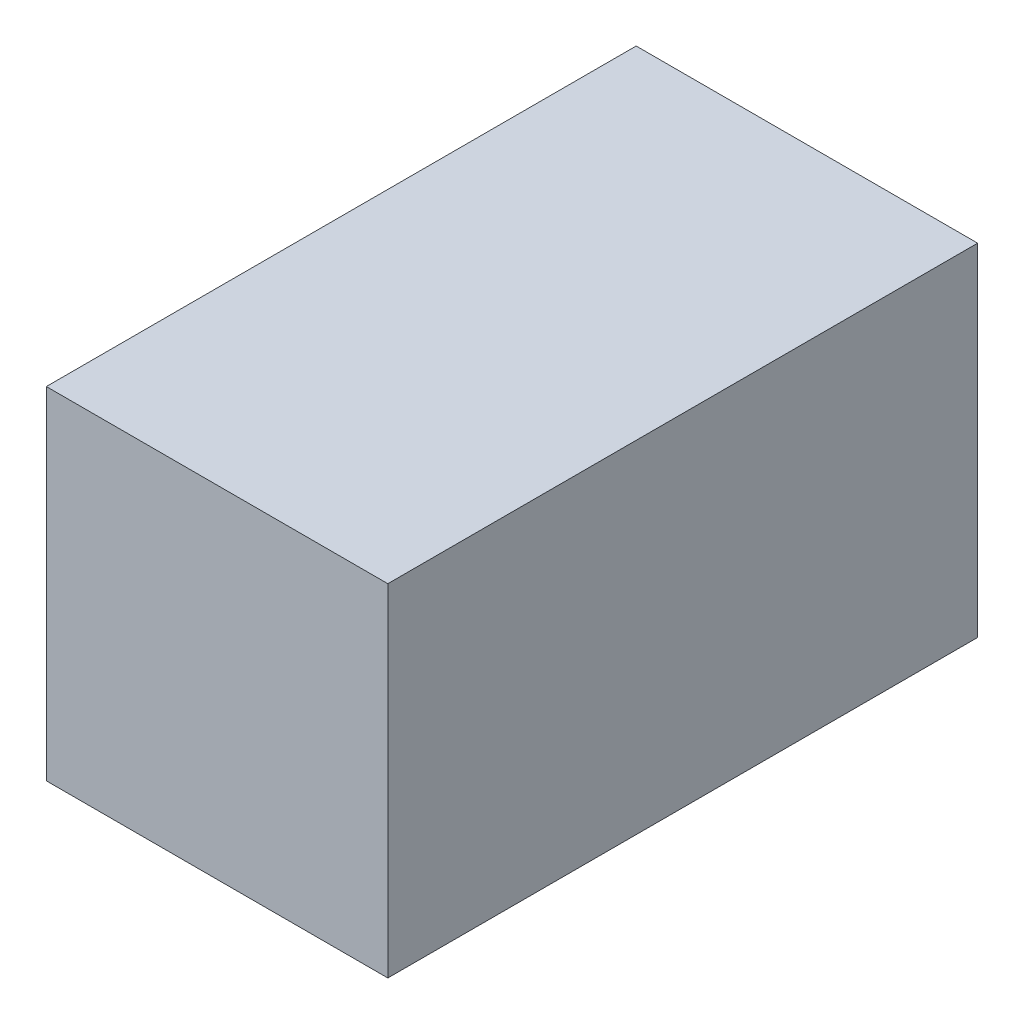
ISO-10303-21;
HEADER;
FILE_DESCRIPTION(('STEP AP214'),'2;1');
FILE_NAME('part.step','',(''),(''),'','','');
FILE_SCHEMA(('AUTOMOTIVE_DESIGN { 1 0 10303 214 1 1 1 1 }'));
ENDSEC;
DATA;
#1=APPLICATION_CONTEXT('core data for automotive mechanical design processes');
#2=APPLICATION_PROTOCOL_DEFINITION('international standard','automotive_design',2000,#1);
#3=PRODUCT_CONTEXT('',#1,'mechanical');
#4=PRODUCT('Part','Part','',(#3));
#5=PRODUCT_RELATED_PRODUCT_CATEGORY('part','',(#4));
#6=PRODUCT_DEFINITION_FORMATION('','',#4);
#7=PRODUCT_DEFINITION_CONTEXT('part definition',#1,'design');
#8=PRODUCT_DEFINITION('design','',#6,#7);
#9=PRODUCT_DEFINITION_SHAPE('','',#8);
#10=(LENGTH_UNIT() NAMED_UNIT(*) SI_UNIT(.MILLI.,.METRE.));
#11=(NAMED_UNIT(*) PLANE_ANGLE_UNIT() SI_UNIT($,.RADIAN.));
#12=(NAMED_UNIT(*) SI_UNIT($,.STERADIAN.) SOLID_ANGLE_UNIT());
#13=UNCERTAINTY_MEASURE_WITH_UNIT(LENGTH_MEASURE(1.E-05),#10,'distance_accuracy_value','');
#14=(GEOMETRIC_REPRESENTATION_CONTEXT(3) GLOBAL_UNCERTAINTY_ASSIGNED_CONTEXT((#13)) GLOBAL_UNIT_ASSIGNED_CONTEXT((#10,
#11,#12)) REPRESENTATION_CONTEXT('',''));
#15=CARTESIAN_POINT('',(0.,0.,0.));
#16=DIRECTION('',(0.,0.,1.));
#17=DIRECTION('',(1.,0.,0.));
#18=AXIS2_PLACEMENT_3D('',#15,#16,#17);
#19=CARTESIAN_POINT('',(-27.5,-27.5,95.));
#20=DIRECTION('',(-1.,0.,0.));
#21=DIRECTION('',(0.,0.,1.));
#22=AXIS2_PLACEMENT_3D('',#19,#20,#21);
#23=PLANE('',#22);
#24=DIRECTION('',(0.,1.,0.));
#25=VECTOR('',#24,1.);
#26=CARTESIAN_POINT('',(-27.5,-27.5,0.));
#27=LINE('',#26,#25);
#28=CARTESIAN_POINT('',(-27.5,-27.5,0.));
#29=VERTEX_POINT('',#28);
#30=CARTESIAN_POINT('',(-27.5,27.5,0.));
#31=VERTEX_POINT('',#30);
#32=EDGE_CURVE('E98',#29,#31,#27,.T.);
#33=ORIENTED_EDGE('',*,*,#32,.F.);
#34=DIRECTION('',(0.,0.,-1.));
#35=VECTOR('',#34,1.);
#36=CARTESIAN_POINT('',(-27.5,-27.5,95.));
#37=LINE('',#36,#35);
#38=CARTESIAN_POINT('',(-27.5,-27.5,95.));
#39=VERTEX_POINT('',#38);
#40=EDGE_CURVE('E11',#39,#29,#37,.T.);
#41=ORIENTED_EDGE('',*,*,#40,.F.);
#42=DIRECTION('',(0.,1.,0.));
#43=VECTOR('',#42,1.);
#44=CARTESIAN_POINT('',(-27.5,-27.5,95.));
#45=LINE('',#44,#43);
#46=CARTESIAN_POINT('',(-27.5,27.5,95.));
#47=VERTEX_POINT('',#46);
#48=EDGE_CURVE('E93',#39,#47,#45,.T.);
#49=ORIENTED_EDGE('',*,*,#48,.T.);
#50=DIRECTION('',(0.,0.,-1.));
#51=VECTOR('',#50,1.);
#52=CARTESIAN_POINT('',(-27.5,27.5,95.));
#53=LINE('',#52,#51);
#54=EDGE_CURVE('E36',#47,#31,#53,.T.);
#55=ORIENTED_EDGE('',*,*,#54,.T.);
#56=EDGE_LOOP('',(#33,#41,#49,#55));
#57=FACE_BOUND('',#56,.T.);
#58=ADVANCED_FACE('F33',(#57),#23,.T.);
#59=CARTESIAN_POINT('',(-27.5,-27.5,95.));
#60=DIRECTION('',(0.,1.,0.));
#61=DIRECTION('',(-1.,0.,0.));
#62=AXIS2_PLACEMENT_3D('',#59,#60,#61);
#63=PLANE('',#62);
#64=DIRECTION('',(1.,0.,0.));
#65=VECTOR('',#64,1.);
#66=CARTESIAN_POINT('',(-27.5,-27.5,0.));
#67=LINE('',#66,#65);
#68=CARTESIAN_POINT('',(27.5,-27.5,0.));
#69=VERTEX_POINT('',#68);
#70=EDGE_CURVE('E66',#29,#69,#67,.T.);
#71=ORIENTED_EDGE('',*,*,#70,.T.);
#72=DIRECTION('',(0.,0.,-1.));
#73=VECTOR('',#72,1.);
#74=CARTESIAN_POINT('',(27.5,-27.5,95.));
#75=LINE('',#74,#73);
#76=CARTESIAN_POINT('',(27.5,-27.5,95.));
#77=VERTEX_POINT('',#76);
#78=EDGE_CURVE('E42',#77,#69,#75,.T.);
#79=ORIENTED_EDGE('',*,*,#78,.F.);
#80=DIRECTION('',(1.,0.,0.));
#81=VECTOR('',#80,1.);
#82=CARTESIAN_POINT('',(-27.5,-27.5,95.));
#83=LINE('',#82,#81);
#84=EDGE_CURVE('E83',#39,#77,#83,.T.);
#85=ORIENTED_EDGE('',*,*,#84,.F.);
#86=ORIENTED_EDGE('',*,*,#40,.T.);
#87=EDGE_LOOP('',(#71,#79,#85,#86));
#88=FACE_BOUND('',#87,.T.);
#89=ADVANCED_FACE('F108',(#88),#63,.F.);
#90=CARTESIAN_POINT('',(27.5,-27.5,95.));
#91=DIRECTION('',(-1.,0.,0.));
#92=DIRECTION('',(0.,0.,1.));
#93=AXIS2_PLACEMENT_3D('',#90,#91,#92);
#94=PLANE('',#93);
#95=DIRECTION('',(0.,1.,0.));
#96=VECTOR('',#95,1.);
#97=CARTESIAN_POINT('',(27.5,-27.5,0.));
#98=LINE('',#97,#96);
#99=CARTESIAN_POINT('',(27.5,27.5,0.));
#100=VERTEX_POINT('',#99);
#101=EDGE_CURVE('E90',#69,#100,#98,.T.);
#102=ORIENTED_EDGE('',*,*,#101,.T.);
#103=DIRECTION('',(0.,0.,-1.));
#104=VECTOR('',#103,1.);
#105=CARTESIAN_POINT('',(27.5,27.5,95.));
#106=LINE('',#105,#104);
#107=CARTESIAN_POINT('',(27.5,27.5,95.));
#108=VERTEX_POINT('',#107);
#109=EDGE_CURVE('E87',#108,#100,#106,.T.);
#110=ORIENTED_EDGE('',*,*,#109,.F.);
#111=DIRECTION('',(0.,1.,0.));
#112=VECTOR('',#111,1.);
#113=CARTESIAN_POINT('',(27.5,-27.5,95.));
#114=LINE('',#113,#112);
#115=EDGE_CURVE('E78',#77,#108,#114,.T.);
#116=ORIENTED_EDGE('',*,*,#115,.F.);
#117=ORIENTED_EDGE('',*,*,#78,.T.);
#118=EDGE_LOOP('',(#102,#110,#116,#117));
#119=FACE_BOUND('',#118,.T.);
#120=ADVANCED_FACE('F88',(#119),#94,.F.);
#121=CARTESIAN_POINT('',(-27.5,27.5,95.));
#122=DIRECTION('',(0.,1.,0.));
#123=DIRECTION('',(0.,0.,1.));
#124=AXIS2_PLACEMENT_3D('',#121,#122,#123);
#125=PLANE('',#124);
#126=DIRECTION('',(1.,0.,0.));
#127=VECTOR('',#126,1.);
#128=CARTESIAN_POINT('',(-27.5,27.5,0.));
#129=LINE('',#128,#127);
#130=EDGE_CURVE('E101',#31,#100,#129,.T.);
#131=ORIENTED_EDGE('',*,*,#130,.F.);
#132=ORIENTED_EDGE('',*,*,#54,.F.);
#133=DIRECTION('',(1.,0.,0.));
#134=VECTOR('',#133,1.);
#135=CARTESIAN_POINT('',(-27.5,27.5,95.));
#136=LINE('',#135,#134);
#137=EDGE_CURVE('E82',#47,#108,#136,.T.);
#138=ORIENTED_EDGE('',*,*,#137,.T.);
#139=ORIENTED_EDGE('',*,*,#109,.T.);
#140=EDGE_LOOP('',(#131,#132,#138,#139));
#141=FACE_BOUND('',#140,.T.);
#142=ADVANCED_FACE('F92',(#141),#125,.T.);
#143=CARTESIAN_POINT('',(0.,0.,95.));
#144=DIRECTION('',(0.,0.,-1.));
#145=DIRECTION('',(-1.,0.,0.));
#146=AXIS2_PLACEMENT_3D('',#143,#144,#145);
#147=PLANE('',#146);
#148=ORIENTED_EDGE('',*,*,#48,.F.);
#149=ORIENTED_EDGE('',*,*,#84,.T.);
#150=ORIENTED_EDGE('',*,*,#115,.T.);
#151=ORIENTED_EDGE('',*,*,#137,.F.);
#152=EDGE_LOOP('',(#148,#149,#150,#151));
#153=FACE_BOUND('',#152,.T.);
#154=ADVANCED_FACE('F81',(#153),#147,.F.);
#155=CARTESIAN_POINT('',(0.,0.,0.));
#156=DIRECTION('',(0.,0.,-1.));
#157=DIRECTION('',(-1.,0.,0.));
#158=AXIS2_PLACEMENT_3D('',#155,#156,#157);
#159=PLANE('',#158);
#160=ORIENTED_EDGE('',*,*,#32,.T.);
#161=ORIENTED_EDGE('',*,*,#130,.T.);
#162=ORIENTED_EDGE('',*,*,#101,.F.);
#163=ORIENTED_EDGE('',*,*,#70,.F.);
#164=EDGE_LOOP('',(#160,#161,#162,#163));
#165=FACE_BOUND('',#164,.T.);
#166=ADVANCED_FACE('F106',(#165),#159,.T.);
#167=CLOSED_SHELL('',(#58,#89,#120,#142,#154,#166));
#168=MANIFOLD_SOLID_BREP('B2',#167);
#169=ADVANCED_BREP_SHAPE_REPRESENTATION('',(#18,#168),#14);
#170=SHAPE_DEFINITION_REPRESENTATION(#9,#169);
ENDSEC;
END-ISO-10303-21;
